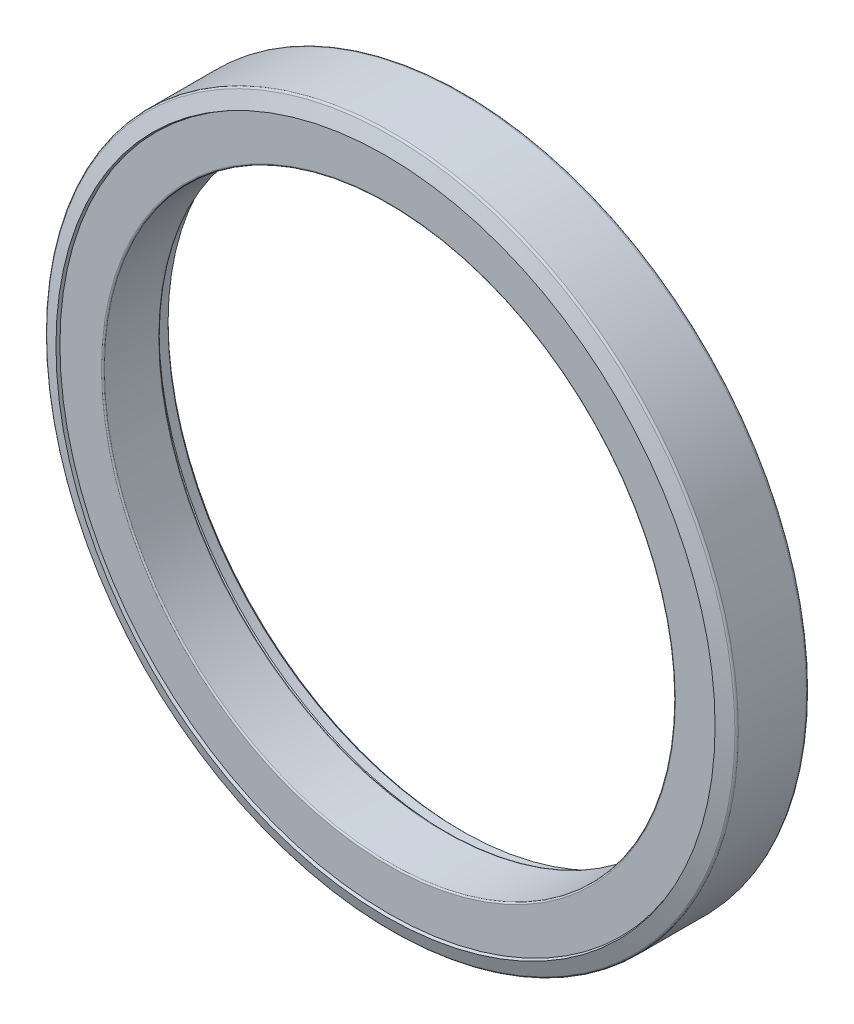
ISO-10303-21;
HEADER;
FILE_DESCRIPTION(('STEP AP214'),'2;1');
FILE_NAME('part.step','',(''),(''),'','','');
FILE_SCHEMA(('AUTOMOTIVE_DESIGN { 1 0 10303 214 1 1 1 1 }'));
ENDSEC;
DATA;
#1=APPLICATION_CONTEXT('core data for automotive mechanical design processes');
#2=APPLICATION_PROTOCOL_DEFINITION('international standard','automotive_design',2000,#1);
#3=PRODUCT_CONTEXT('',#1,'mechanical');
#4=PRODUCT('Part','Part','',(#3));
#5=PRODUCT_RELATED_PRODUCT_CATEGORY('part','',(#4));
#6=PRODUCT_DEFINITION_FORMATION('','',#4);
#7=PRODUCT_DEFINITION_CONTEXT('part definition',#1,'design');
#8=PRODUCT_DEFINITION('design','',#6,#7);
#9=PRODUCT_DEFINITION_SHAPE('','',#8);
#10=(LENGTH_UNIT() NAMED_UNIT(*) SI_UNIT(.MILLI.,.METRE.));
#11=(NAMED_UNIT(*) PLANE_ANGLE_UNIT() SI_UNIT($,.RADIAN.));
#12=(NAMED_UNIT(*) SI_UNIT($,.STERADIAN.) SOLID_ANGLE_UNIT());
#13=UNCERTAINTY_MEASURE_WITH_UNIT(LENGTH_MEASURE(1.E-05),#10,'distance_accuracy_value','');
#14=(GEOMETRIC_REPRESENTATION_CONTEXT(3) GLOBAL_UNCERTAINTY_ASSIGNED_CONTEXT((#13)) GLOBAL_UNIT_ASSIGNED_CONTEXT((#10,
#11,#12)) REPRESENTATION_CONTEXT('',''));
#15=CARTESIAN_POINT('',(0.,0.,0.));
#16=DIRECTION('',(0.,0.,1.));
#17=DIRECTION('',(1.,0.,0.));
#18=AXIS2_PLACEMENT_3D('',#15,#16,#17);
#19=CARTESIAN_POINT('',(0.,0.,-3.6195));
#20=DIRECTION('',(0.,0.,1.));
#21=DIRECTION('',(1.,0.,0.));
#22=AXIS2_PLACEMENT_3D('',#19,#20,#21);
#23=PLANE('',#22);
#24=CARTESIAN_POINT('',(0.,0.,-3.6195));
#25=DIRECTION('',(0.,0.,1.));
#26=DIRECTION('',(0.,1.,0.));
#27=AXIS2_PLACEMENT_3D('',#24,#25,#26);
#28=CIRCLE('',#27,51.054);
#29=CARTESIAN_POINT('',(0.,51.054,-3.6195));
#30=VERTEX_POINT('',#29);
#31=EDGE_CURVE('E141',#30,#30,#28,.F.);
#32=ORIENTED_EDGE('',*,*,#31,.T.);
#33=EDGE_LOOP('',(#32));
#34=FACE_BOUND('',#33,.T.);
#35=CARTESIAN_POINT('',(0.,0.,-3.6195));
#36=DIRECTION('',(0.,0.,-1.));
#37=DIRECTION('',(1.,0.,0.));
#38=AXIS2_PLACEMENT_3D('',#35,#36,#37);
#39=CIRCLE('',#38,49.9872);
#40=CARTESIAN_POINT('',(49.9872,0.,-3.6195));
#41=VERTEX_POINT('',#40);
#42=EDGE_CURVE('E172',#41,#41,#39,.T.);
#43=ORIENTED_EDGE('',*,*,#42,.F.);
#44=EDGE_LOOP('',(#43));
#45=FACE_BOUND('',#44,.T.);
#46=ADVANCED_FACE('F13',(#34,#45),#23,.F.);
#47=CARTESIAN_POINT('',(0.,0.,-3.4163));
#48=DIRECTION('',(0.,0.,1.));
#49=DIRECTION('',(1.,0.,0.));
#50=AXIS2_PLACEMENT_3D('',#47,#48,#49);
#51=TOROIDAL_SURFACE('',#50,49.9872,0.2032);
#52=CARTESIAN_POINT('',(0.,0.,-3.4163));
#53=DIRECTION('',(0.,0.,1.));
#54=DIRECTION('',(1.,0.,0.));
#55=AXIS2_PLACEMENT_3D('',#52,#53,#54);
#56=CIRCLE('',#55,49.784);
#57=CARTESIAN_POINT('',(49.784,0.,-3.4163));
#58=VERTEX_POINT('',#57);
#59=EDGE_CURVE('E136',#58,#58,#56,.T.);
#60=ORIENTED_EDGE('',*,*,#59,.T.);
#61=EDGE_LOOP('',(#60));
#62=FACE_BOUND('',#61,.T.);
#63=ORIENTED_EDGE('',*,*,#42,.T.);
#64=EDGE_LOOP('',(#63));
#65=FACE_BOUND('',#64,.T.);
#66=ADVANCED_FACE('F153',(#62,#65),#51,.T.);
#67=CARTESIAN_POINT('',(0.,0.,-4.0005));
#68=DIRECTION('',(0.,0.,1.));
#69=DIRECTION('',(1.,0.,0.));
#70=AXIS2_PLACEMENT_3D('',#67,#68,#69);
#71=TOROIDAL_SURFACE('',#70,51.054,0.381);
#72=CARTESIAN_POINT('',(0.,0.,-4.20239923967285));
#73=DIRECTION('',(0.,0.,1.));
#74=DIRECTION('',(1.,0.,0.));
#75=AXIS2_PLACEMENT_3D('',#72,#73,#74);
#76=CIRCLE('',#75,51.3771063246356);
#77=CARTESIAN_POINT('',(51.3771063246356,0.,-4.20239923967285));
#78=VERTEX_POINT('',#77);
#79=EDGE_CURVE('E128',#78,#78,#76,.F.);
#80=ORIENTED_EDGE('',*,*,#79,.T.);
#81=EDGE_LOOP('',(#80));
#82=FACE_BOUND('',#81,.T.);
#83=ORIENTED_EDGE('',*,*,#31,.F.);
#84=EDGE_LOOP('',(#83));
#85=FACE_BOUND('',#84,.T.);
#86=ADVANCED_FACE('F149',(#82,#85),#71,.F.);
#87=CARTESIAN_POINT('',(0.,0.,6.8199));
#88=DIRECTION('',(0.,0.,1.));
#89=DIRECTION('',(1.,0.,0.));
#90=AXIS2_PLACEMENT_3D('',#87,#88,#89);
#91=CYLINDRICAL_SURFACE('',#90,49.784);
#92=CARTESIAN_POINT('',(0.,0.,6.05789999999994));
#93=DIRECTION('',(0.,0.,-1.));
#94=DIRECTION('',(-1.,0.,0.));
#95=AXIS2_PLACEMENT_3D('',#92,#93,#94);
#96=CIRCLE('',#95,49.784);
#97=CARTESIAN_POINT('',(-49.784,0.,6.05789999999994));
#98=VERTEX_POINT('',#97);
#99=EDGE_CURVE('E109',#98,#98,#96,.T.);
#100=ORIENTED_EDGE('',*,*,#99,.F.);
#101=EDGE_LOOP('',(#100));
#102=FACE_BOUND('',#101,.T.);
#103=ORIENTED_EDGE('',*,*,#59,.F.);
#104=EDGE_LOOP('',(#103));
#105=FACE_BOUND('',#104,.T.);
#106=ADVANCED_FACE('F152',(#102,#105),#91,.F.);
#107=CARTESIAN_POINT('',(0.,0.,-4.20239923967285));
#108=DIRECTION('',(0.,0.,1.));
#109=DIRECTION('',(1.,0.,0.));
#110=AXIS2_PLACEMENT_3D('',#107,#108,#109);
#111=CONICAL_SURFACE('',#110,51.3771063246356,0.558505360638195);
#112=CARTESIAN_POINT('',(0.,0.,-4.71947744753874));
#113=DIRECTION('',(0.,0.,-1.));
#114=DIRECTION('',(-1.,0.,0.));
#115=AXIS2_PLACEMENT_3D('',#112,#113,#114);
#116=CIRCLE('',#115,51.054);
#117=CARTESIAN_POINT('',(-51.054,0.,-4.71947744753874));
#118=VERTEX_POINT('',#117);
#119=EDGE_CURVE('E100',#118,#118,#116,.T.);
#120=ORIENTED_EDGE('',*,*,#119,.T.);
#121=EDGE_LOOP('',(#120));
#122=FACE_BOUND('',#121,.T.);
#123=ORIENTED_EDGE('',*,*,#79,.F.);
#124=EDGE_LOOP('',(#123));
#125=FACE_BOUND('',#124,.T.);
#126=ADVANCED_FACE('F119',(#122,#125),#111,.F.);
#127=CARTESIAN_POINT('',(0.,0.,6.05789999999994));
#128=DIRECTION('',(0.,0.,-1.));
#129=DIRECTION('',(-1.,0.,0.));
#130=AXIS2_PLACEMENT_3D('',#127,#128,#129);
#131=TOROIDAL_SURFACE('',#130,50.038,0.254);
#132=ORIENTED_EDGE('',*,*,#99,.T.);
#133=EDGE_LOOP('',(#132));
#134=FACE_BOUND('',#133,.T.);
#135=CARTESIAN_POINT('',(0.,0.,6.31189999999994));
#136=DIRECTION('',(0.,0.,1.));
#137=DIRECTION('',(-1.,0.,0.));
#138=AXIS2_PLACEMENT_3D('',#135,#136,#137);
#139=CIRCLE('',#138,50.038);
#140=CARTESIAN_POINT('',(-50.038,0.,6.31189999999994));
#141=VERTEX_POINT('',#140);
#142=EDGE_CURVE('E108',#141,#141,#139,.T.);
#143=ORIENTED_EDGE('',*,*,#142,.T.);
#144=EDGE_LOOP('',(#143));
#145=FACE_BOUND('',#144,.T.);
#146=ADVANCED_FACE('F115',(#134,#145),#131,.T.);
#147=CARTESIAN_POINT('',(0.,0.,-6.8199));
#148=DIRECTION('',(0.,0.,-1.));
#149=DIRECTION('',(-1.,0.,0.));
#150=AXIS2_PLACEMENT_3D('',#147,#148,#149);
#151=CYLINDRICAL_SURFACE('',#150,51.054);
#152=ORIENTED_EDGE('',*,*,#119,.F.);
#153=EDGE_LOOP('',(#152));
#154=FACE_BOUND('',#153,.T.);
#155=CARTESIAN_POINT('',(0.,0.,-6.31190000000001));
#156=DIRECTION('',(0.,0.,-1.));
#157=DIRECTION('',(-1.,0.,0.));
#158=AXIS2_PLACEMENT_3D('',#155,#156,#157);
#159=CIRCLE('',#158,51.054);
#160=CARTESIAN_POINT('',(-51.054,0.,-6.31190000000001));
#161=VERTEX_POINT('',#160);
#162=EDGE_CURVE('E184',#161,#161,#159,.T.);
#163=ORIENTED_EDGE('',*,*,#162,.T.);
#164=EDGE_LOOP('',(#163));
#165=FACE_BOUND('',#164,.T.);
#166=ADVANCED_FACE('F90',(#154,#165),#151,.F.);
#167=CARTESIAN_POINT('',(0.,0.,6.31189999999994));
#168=DIRECTION('',(0.,0.,-1.));
#169=DIRECTION('',(-1.,0.,0.));
#170=AXIS2_PLACEMENT_3D('',#167,#168,#169);
#171=PLANE('',#170);
#172=CARTESIAN_POINT('',(0.,0.,6.31189999999993));
#173=DIRECTION('',(0.,0.,1.));
#174=DIRECTION('',(1.,0.,0.));
#175=AXIS2_PLACEMENT_3D('',#172,#173,#174);
#176=CIRCLE('',#175,57.2826031209927);
#177=CARTESIAN_POINT('',(57.2826031209927,0.,6.31189999999993));
#178=VERTEX_POINT('',#177);
#179=EDGE_CURVE('E17',#178,#178,#176,.T.);
#180=ORIENTED_EDGE('',*,*,#179,.T.);
#181=EDGE_LOOP('',(#180));
#182=FACE_BOUND('',#181,.T.);
#183=ORIENTED_EDGE('',*,*,#142,.F.);
#184=EDGE_LOOP('',(#183));
#185=FACE_BOUND('',#184,.T.);
#186=ADVANCED_FACE('F85',(#182,#185),#171,.F.);
#187=CARTESIAN_POINT('',(0.,0.,-6.8199));
#188=DIRECTION('',(0.,0.,-1.));
#189=DIRECTION('',(-1.,0.,0.));
#190=AXIS2_PLACEMENT_3D('',#187,#188,#189);
#191=CONICAL_SURFACE('',#190,51.562,0.785398163397442);
#192=CARTESIAN_POINT('',(0.,0.,-6.8199));
#193=DIRECTION('',(0.,0.,-1.));
#194=DIRECTION('',(-1.,0.,0.));
#195=AXIS2_PLACEMENT_3D('',#192,#193,#194);
#196=CIRCLE('',#195,51.562);
#197=CARTESIAN_POINT('',(-51.562,0.,-6.8199));
#198=VERTEX_POINT('',#197);
#199=EDGE_CURVE('E59',#198,#198,#196,.F.);
#200=ORIENTED_EDGE('',*,*,#199,.F.);
#201=EDGE_LOOP('',(#200));
#202=FACE_BOUND('',#201,.T.);
#203=ORIENTED_EDGE('',*,*,#162,.F.);
#204=EDGE_LOOP('',(#203));
#205=FACE_BOUND('',#204,.T.);
#206=ADVANCED_FACE('F81',(#202,#205),#191,.F.);
#207=CARTESIAN_POINT('',(0.,0.,6.8199));
#208=DIRECTION('',(0.,0.,1.));
#209=DIRECTION('',(1.,0.,0.));
#210=AXIS2_PLACEMENT_3D('',#207,#208,#209);
#211=CONICAL_SURFACE('',#210,57.4675,0.349065850398871);
#212=CARTESIAN_POINT('',(0.,0.,6.81990000000001));
#213=DIRECTION('',(0.,0.,-1.));
#214=DIRECTION('',(-1.,0.,0.));
#215=AXIS2_PLACEMENT_3D('',#212,#213,#214);
#216=CIRCLE('',#215,57.4675);
#217=CARTESIAN_POINT('',(-57.4675,0.,6.81990000000001));
#218=VERTEX_POINT('',#217);
#219=EDGE_CURVE('E55',#218,#218,#216,.T.);
#220=ORIENTED_EDGE('',*,*,#219,.F.);
#221=EDGE_LOOP('',(#220));
#222=FACE_BOUND('',#221,.T.);
#223=ORIENTED_EDGE('',*,*,#179,.F.);
#224=EDGE_LOOP('',(#223));
#225=FACE_BOUND('',#224,.T.);
#226=ADVANCED_FACE('F78',(#222,#225),#211,.F.);
#227=CARTESIAN_POINT('',(0.,0.,-6.8199));
#228=DIRECTION('',(0.,0.,-1.));
#229=DIRECTION('',(-1.,0.,0.));
#230=AXIS2_PLACEMENT_3D('',#227,#228,#229);
#231=PLANE('',#230);
#232=CARTESIAN_POINT('',(0.,0.,-6.8199));
#233=DIRECTION('',(0.,0.,1.));
#234=DIRECTION('',(-1.,0.,0.));
#235=AXIS2_PLACEMENT_3D('',#232,#233,#234);
#236=CIRCLE('',#235,59.7408);
#237=CARTESIAN_POINT('',(-59.7408,0.,-6.8199));
#238=VERTEX_POINT('',#237);
#239=EDGE_CURVE('E58',#238,#238,#236,.T.);
#240=ORIENTED_EDGE('',*,*,#239,.F.);
#241=EDGE_LOOP('',(#240));
#242=FACE_BOUND('',#241,.T.);
#243=ORIENTED_EDGE('',*,*,#199,.T.);
#244=EDGE_LOOP('',(#243));
#245=FACE_BOUND('',#244,.T.);
#246=ADVANCED_FACE('F69',(#242,#245),#231,.T.);
#247=CARTESIAN_POINT('',(0.,0.,5.89883340389695));
#248=DIRECTION('',(0.,0.,-1.));
#249=DIRECTION('',(-1.,0.,0.));
#250=AXIS2_PLACEMENT_3D('',#247,#248,#249);
#251=CONICAL_SURFACE('',#250,59.9981096746071,1.22173047639603);
#252=ORIENTED_EDGE('',*,*,#219,.T.);
#253=EDGE_LOOP('',(#252));
#254=FACE_BOUND('',#253,.T.);
#255=CARTESIAN_POINT('',(0.,0.,5.89883340389695));
#256=DIRECTION('',(0.,0.,-1.));
#257=DIRECTION('',(-1.,0.,0.));
#258=AXIS2_PLACEMENT_3D('',#255,#256,#257);
#259=CIRCLE('',#258,59.9981096746071);
#260=CARTESIAN_POINT('',(-59.9981096746071,0.,5.89883340389695));
#261=VERTEX_POINT('',#260);
#262=EDGE_CURVE('E26',#261,#261,#259,.T.);
#263=ORIENTED_EDGE('',*,*,#262,.F.);
#264=EDGE_LOOP('',(#263));
#265=FACE_BOUND('',#264,.T.);
#266=ADVANCED_FACE('F48',(#254,#265),#251,.T.);
#267=CARTESIAN_POINT('',(0.,0.,-6.3119));
#268=DIRECTION('',(0.,0.,-1.));
#269=DIRECTION('',(-1.,0.,0.));
#270=AXIS2_PLACEMENT_3D('',#267,#268,#269);
#271=TOROIDAL_SURFACE('',#270,59.7408,0.508);
#272=ORIENTED_EDGE('',*,*,#239,.T.);
#273=EDGE_LOOP('',(#272));
#274=FACE_BOUND('',#273,.T.);
#275=CARTESIAN_POINT('',(0.,0.,-6.3119));
#276=DIRECTION('',(0.,0.,1.));
#277=DIRECTION('',(1.,0.,0.));
#278=AXIS2_PLACEMENT_3D('',#275,#276,#277);
#279=CIRCLE('',#278,60.2488);
#280=CARTESIAN_POINT('',(60.2488,0.,-6.3119));
#281=VERTEX_POINT('',#280);
#282=EDGE_CURVE('E21',#281,#281,#279,.T.);
#283=ORIENTED_EDGE('',*,*,#282,.F.);
#284=EDGE_LOOP('',(#283));
#285=FACE_BOUND('',#284,.T.);
#286=ADVANCED_FACE('F42',(#274,#285),#271,.T.);
#287=CARTESIAN_POINT('',(0.,0.,5.54081051537752));
#288=DIRECTION('',(0.,0.,-1.));
#289=DIRECTION('',(-1.,0.,0.));
#290=AXIS2_PLACEMENT_3D('',#287,#288,#289);
#291=TOROIDAL_SURFACE('',#290,59.8678,0.381);
#292=ORIENTED_EDGE('',*,*,#262,.T.);
#293=EDGE_LOOP('',(#292));
#294=FACE_BOUND('',#293,.T.);
#295=CARTESIAN_POINT('',(0.,0.,5.54081051537752));
#296=DIRECTION('',(0.,0.,1.));
#297=DIRECTION('',(1.,0.,0.));
#298=AXIS2_PLACEMENT_3D('',#295,#296,#297);
#299=CIRCLE('',#298,60.2488);
#300=CARTESIAN_POINT('',(60.2488,0.,5.54081051537752));
#301=VERTEX_POINT('',#300);
#302=EDGE_CURVE('E9',#301,#301,#299,.F.);
#303=ORIENTED_EDGE('',*,*,#302,.F.);
#304=EDGE_LOOP('',(#303));
#305=FACE_BOUND('',#304,.T.);
#306=ADVANCED_FACE('F37',(#294,#305),#291,.T.);
#307=CARTESIAN_POINT('',(0.,0.,6.8199));
#308=DIRECTION('',(0.,0.,1.));
#309=DIRECTION('',(1.,0.,0.));
#310=AXIS2_PLACEMENT_3D('',#307,#308,#309);
#311=CYLINDRICAL_SURFACE('',#310,60.2488);
#312=ORIENTED_EDGE('',*,*,#302,.T.);
#313=EDGE_LOOP('',(#312));
#314=FACE_BOUND('',#313,.T.);
#315=ORIENTED_EDGE('',*,*,#282,.T.);
#316=EDGE_LOOP('',(#315));
#317=FACE_BOUND('',#316,.T.);
#318=ADVANCED_FACE('F41',(#314,#317),#311,.T.);
#319=CLOSED_SHELL('',(#46,#66,#86,#106,#126,#146,#166,#186,#206,#226,#246,#266,#286,#306,#318));
#320=MANIFOLD_SOLID_BREP('B1',#319);
#321=ADVANCED_BREP_SHAPE_REPRESENTATION('',(#18,#320),#14);
#322=SHAPE_DEFINITION_REPRESENTATION(#9,#321);
ENDSEC;
END-ISO-10303-21;
